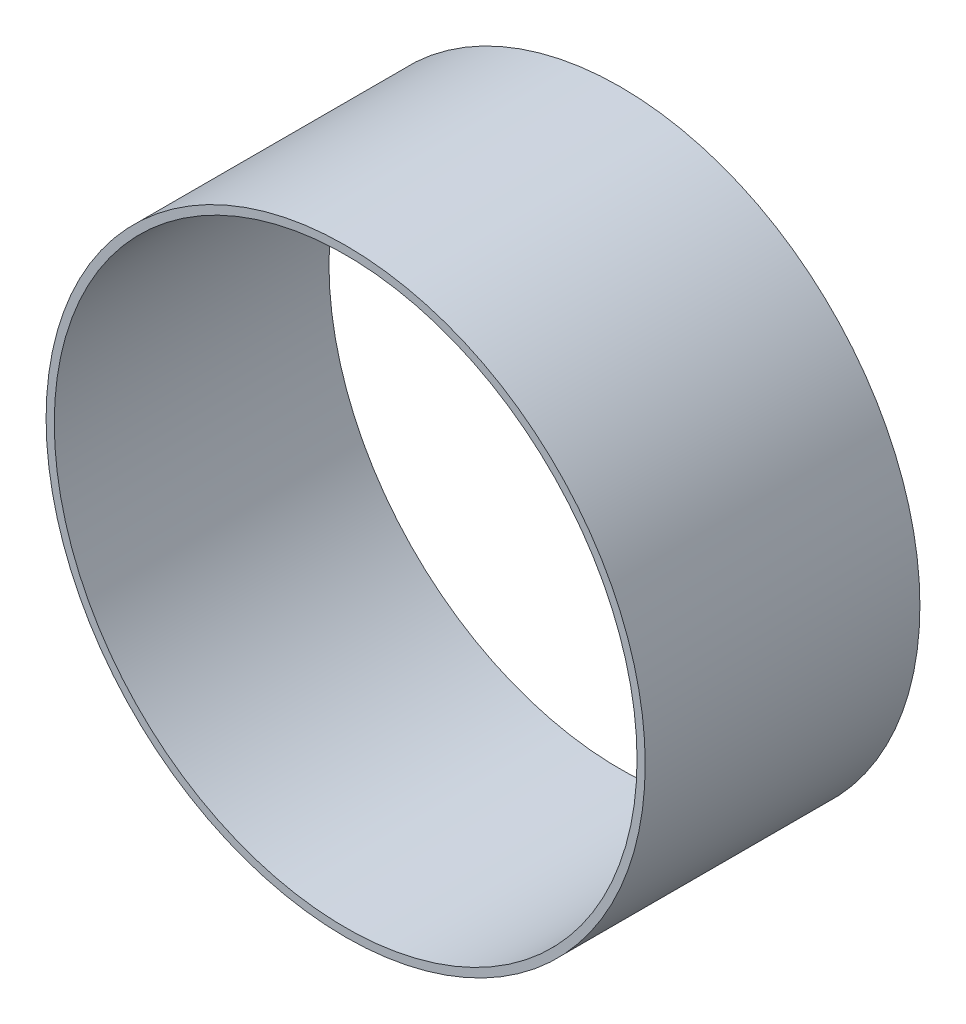
ISO-10303-21;
HEADER;
FILE_DESCRIPTION(('STEP AP214'),'2;1');
FILE_NAME('part.step','',(''),(''),'','','');
FILE_SCHEMA(('AUTOMOTIVE_DESIGN { 1 0 10303 214 1 1 1 1 }'));
ENDSEC;
DATA;
#1=APPLICATION_CONTEXT('core data for automotive mechanical design processes');
#2=APPLICATION_PROTOCOL_DEFINITION('international standard','automotive_design',2000,#1);
#3=PRODUCT_CONTEXT('',#1,'mechanical');
#4=PRODUCT('Part','Part','',(#3));
#5=PRODUCT_RELATED_PRODUCT_CATEGORY('part','',(#4));
#6=PRODUCT_DEFINITION_FORMATION('','',#4);
#7=PRODUCT_DEFINITION_CONTEXT('part definition',#1,'design');
#8=PRODUCT_DEFINITION('design','',#6,#7);
#9=PRODUCT_DEFINITION_SHAPE('','',#8);
#10=(LENGTH_UNIT() NAMED_UNIT(*) SI_UNIT(.MILLI.,.METRE.));
#11=(NAMED_UNIT(*) PLANE_ANGLE_UNIT() SI_UNIT($,.RADIAN.));
#12=(NAMED_UNIT(*) SI_UNIT($,.STERADIAN.) SOLID_ANGLE_UNIT());
#13=UNCERTAINTY_MEASURE_WITH_UNIT(LENGTH_MEASURE(1.E-05),#10,'distance_accuracy_value','');
#14=(GEOMETRIC_REPRESENTATION_CONTEXT(3) GLOBAL_UNCERTAINTY_ASSIGNED_CONTEXT((#13)) GLOBAL_UNIT_ASSIGNED_CONTEXT((#10,
#11,#12)) REPRESENTATION_CONTEXT('',''));
#15=CARTESIAN_POINT('',(0.,0.,0.));
#16=DIRECTION('',(0.,0.,1.));
#17=DIRECTION('',(1.,0.,0.));
#18=AXIS2_PLACEMENT_3D('',#15,#16,#17);
#19=CARTESIAN_POINT('',(0.,0.,20.32));
#20=DIRECTION('',(0.,0.,-1.));
#21=DIRECTION('',(-1.,0.,0.));
#22=AXIS2_PLACEMENT_3D('',#19,#20,#21);
#23=CYLINDRICAL_SURFACE('',#22,22.16);
#24=CARTESIAN_POINT('',(0.,0.,20.32));
#25=DIRECTION('',(0.,0.,1.));
#26=DIRECTION('',(1.,0.,0.));
#27=AXIS2_PLACEMENT_3D('',#24,#25,#26);
#28=CIRCLE('',#27,22.16);
#29=CARTESIAN_POINT('',(22.16,0.,20.32));
#30=VERTEX_POINT('',#29);
#31=EDGE_CURVE('E10',#30,#30,#28,.T.);
#32=ORIENTED_EDGE('',*,*,#31,.F.);
#33=EDGE_LOOP('',(#32));
#34=FACE_BOUND('',#33,.T.);
#35=CARTESIAN_POINT('',(0.,0.,0.));
#36=DIRECTION('',(0.,0.,1.));
#37=DIRECTION('',(1.,0.,0.));
#38=AXIS2_PLACEMENT_3D('',#35,#36,#37);
#39=CIRCLE('',#38,22.16);
#40=CARTESIAN_POINT('',(22.16,0.,0.));
#41=VERTEX_POINT('',#40);
#42=EDGE_CURVE('E44',#41,#41,#39,.T.);
#43=ORIENTED_EDGE('',*,*,#42,.T.);
#44=EDGE_LOOP('',(#43));
#45=FACE_BOUND('',#44,.T.);
#46=ADVANCED_FACE('F41',(#34,#45),#23,.T.);
#47=CARTESIAN_POINT('',(0.,0.,20.32));
#48=DIRECTION('',(0.,0.,1.));
#49=DIRECTION('',(1.,0.,0.));
#50=AXIS2_PLACEMENT_3D('',#47,#48,#49);
#51=PLANE('',#50);
#52=CARTESIAN_POINT('',(0.,0.,20.32));
#53=DIRECTION('',(0.,0.,1.));
#54=DIRECTION('',(1.,0.,0.));
#55=AXIS2_PLACEMENT_3D('',#52,#53,#54);
#56=CIRCLE('',#55,21.555);
#57=CARTESIAN_POINT('',(21.555,0.,20.32));
#58=VERTEX_POINT('',#57);
#59=EDGE_CURVE('E55',#58,#58,#56,.T.);
#60=ORIENTED_EDGE('',*,*,#59,.F.);
#61=EDGE_LOOP('',(#60));
#62=FACE_BOUND('',#61,.T.);
#63=ORIENTED_EDGE('',*,*,#31,.T.);
#64=EDGE_LOOP('',(#63));
#65=FACE_BOUND('',#64,.T.);
#66=ADVANCED_FACE('F72',(#62,#65),#51,.T.);
#67=CARTESIAN_POINT('',(0.,0.,0.));
#68=DIRECTION('',(0.,0.,1.));
#69=DIRECTION('',(1.,0.,0.));
#70=AXIS2_PLACEMENT_3D('',#67,#68,#69);
#71=PLANE('',#70);
#72=CARTESIAN_POINT('',(0.,0.,0.));
#73=DIRECTION('',(0.,0.,1.));
#74=DIRECTION('',(1.,0.,0.));
#75=AXIS2_PLACEMENT_3D('',#72,#73,#74);
#76=CIRCLE('',#75,21.555);
#77=CARTESIAN_POINT('',(21.555,0.,0.));
#78=VERTEX_POINT('',#77);
#79=EDGE_CURVE('E53',#78,#78,#76,.T.);
#80=ORIENTED_EDGE('',*,*,#79,.T.);
#81=EDGE_LOOP('',(#80));
#82=FACE_BOUND('',#81,.T.);
#83=ORIENTED_EDGE('',*,*,#42,.F.);
#84=EDGE_LOOP('',(#83));
#85=FACE_BOUND('',#84,.T.);
#86=ADVANCED_FACE('F63',(#82,#85),#71,.F.);
#87=CARTESIAN_POINT('',(0.,0.,0.));
#88=DIRECTION('',(0.,0.,1.));
#89=DIRECTION('',(1.,0.,0.));
#90=AXIS2_PLACEMENT_3D('',#87,#88,#89);
#91=CYLINDRICAL_SURFACE('',#90,21.555);
#92=ORIENTED_EDGE('',*,*,#79,.F.);
#93=EDGE_LOOP('',(#92));
#94=FACE_BOUND('',#93,.T.);
#95=ORIENTED_EDGE('',*,*,#59,.T.);
#96=EDGE_LOOP('',(#95));
#97=FACE_BOUND('',#96,.T.);
#98=ADVANCED_FACE('F66',(#94,#97),#91,.F.);
#99=CLOSED_SHELL('',(#46,#66,#86,#98));
#100=MANIFOLD_SOLID_BREP('B2',#99);
#101=ADVANCED_BREP_SHAPE_REPRESENTATION('',(#18,#100),#14);
#102=SHAPE_DEFINITION_REPRESENTATION(#9,#101);
ENDSEC;
END-ISO-10303-21;
